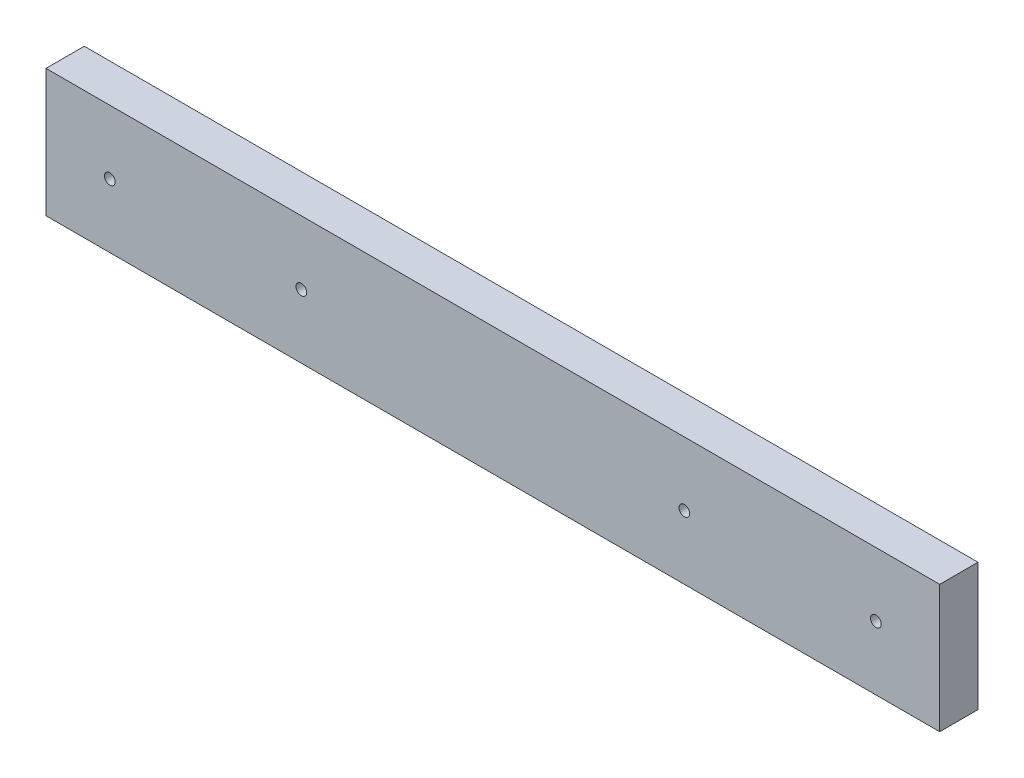
ISO-10303-21;
HEADER;
FILE_DESCRIPTION(('STEP AP214'),'2;1');
FILE_NAME('part.step','',(''),(''),'','','');
FILE_SCHEMA(('AUTOMOTIVE_DESIGN { 1 0 10303 214 1 1 1 1 }'));
ENDSEC;
DATA;
#1=APPLICATION_CONTEXT('core data for automotive mechanical design processes');
#2=APPLICATION_PROTOCOL_DEFINITION('international standard','automotive_design',2000,#1);
#3=PRODUCT_CONTEXT('',#1,'mechanical');
#4=PRODUCT('Part','Part','',(#3));
#5=PRODUCT_RELATED_PRODUCT_CATEGORY('part','',(#4));
#6=PRODUCT_DEFINITION_FORMATION('','',#4);
#7=PRODUCT_DEFINITION_CONTEXT('part definition',#1,'design');
#8=PRODUCT_DEFINITION('design','',#6,#7);
#9=PRODUCT_DEFINITION_SHAPE('','',#8);
#10=(LENGTH_UNIT() NAMED_UNIT(*) SI_UNIT(.MILLI.,.METRE.));
#11=(NAMED_UNIT(*) PLANE_ANGLE_UNIT() SI_UNIT($,.RADIAN.));
#12=(NAMED_UNIT(*) SI_UNIT($,.STERADIAN.) SOLID_ANGLE_UNIT());
#13=UNCERTAINTY_MEASURE_WITH_UNIT(LENGTH_MEASURE(1.E-05),#10,'distance_accuracy_value','');
#14=(GEOMETRIC_REPRESENTATION_CONTEXT(3) GLOBAL_UNCERTAINTY_ASSIGNED_CONTEXT((#13)) GLOBAL_UNIT_ASSIGNED_CONTEXT((#10,
#11,#12)) REPRESENTATION_CONTEXT('',''));
#15=CARTESIAN_POINT('',(0.,0.,0.));
#16=DIRECTION('',(0.,0.,1.));
#17=DIRECTION('',(1.,0.,0.));
#18=AXIS2_PLACEMENT_3D('',#15,#16,#17);
#19=CARTESIAN_POINT('',(175.,-25.,-15.));
#20=DIRECTION('',(1.,0.,0.));
#21=DIRECTION('',(0.,0.,-1.));
#22=AXIS2_PLACEMENT_3D('',#19,#20,#21);
#23=PLANE('',#22);
#24=DIRECTION('',(0.,1.,0.));
#25=VECTOR('',#24,1.);
#26=CARTESIAN_POINT('',(175.,-25.,0.));
#27=LINE('',#26,#25);
#28=CARTESIAN_POINT('',(175.,-25.,0.));
#29=VERTEX_POINT('',#28);
#30=CARTESIAN_POINT('',(175.,25.,0.));
#31=VERTEX_POINT('',#30);
#32=EDGE_CURVE('E156',#29,#31,#27,.T.);
#33=ORIENTED_EDGE('',*,*,#32,.F.);
#34=DIRECTION('',(0.,0.,1.));
#35=VECTOR('',#34,1.);
#36=CARTESIAN_POINT('',(175.,-25.,-15.));
#37=LINE('',#36,#35);
#38=CARTESIAN_POINT('',(175.,-25.,-15.));
#39=VERTEX_POINT('',#38);
#40=EDGE_CURVE('E11',#39,#29,#37,.T.);
#41=ORIENTED_EDGE('',*,*,#40,.F.);
#42=DIRECTION('',(0.,1.,0.));
#43=VECTOR('',#42,1.);
#44=CARTESIAN_POINT('',(175.,-25.,-15.));
#45=LINE('',#44,#43);
#46=CARTESIAN_POINT('',(175.,25.,-15.));
#47=VERTEX_POINT('',#46);
#48=EDGE_CURVE('E157',#39,#47,#45,.T.);
#49=ORIENTED_EDGE('',*,*,#48,.T.);
#50=DIRECTION('',(0.,0.,1.));
#51=VECTOR('',#50,1.);
#52=CARTESIAN_POINT('',(175.,25.,-15.));
#53=LINE('',#52,#51);
#54=EDGE_CURVE('E50',#47,#31,#53,.T.);
#55=ORIENTED_EDGE('',*,*,#54,.T.);
#56=EDGE_LOOP('',(#33,#41,#49,#55));
#57=FACE_BOUND('',#56,.T.);
#58=ADVANCED_FACE('F47',(#57),#23,.T.);
#59=CARTESIAN_POINT('',(-175.,-25.,-15.));
#60=DIRECTION('',(0.,-1.,0.));
#61=DIRECTION('',(0.,0.,-1.));
#62=AXIS2_PLACEMENT_3D('',#59,#60,#61);
#63=PLANE('',#62);
#64=DIRECTION('',(1.,0.,0.));
#65=VECTOR('',#64,1.);
#66=CARTESIAN_POINT('',(-175.,-25.,0.));
#67=LINE('',#66,#65);
#68=CARTESIAN_POINT('',(-175.,-25.,0.));
#69=VERTEX_POINT('',#68);
#70=EDGE_CURVE('E160',#69,#29,#67,.T.);
#71=ORIENTED_EDGE('',*,*,#70,.F.);
#72=DIRECTION('',(0.,0.,1.));
#73=VECTOR('',#72,1.);
#74=CARTESIAN_POINT('',(-175.,-25.,-15.));
#75=LINE('',#74,#73);
#76=CARTESIAN_POINT('',(-175.,-25.,-15.));
#77=VERTEX_POINT('',#76);
#78=EDGE_CURVE('E57',#77,#69,#75,.T.);
#79=ORIENTED_EDGE('',*,*,#78,.F.);
#80=DIRECTION('',(1.,0.,0.));
#81=VECTOR('',#80,1.);
#82=CARTESIAN_POINT('',(-175.,-25.,-15.));
#83=LINE('',#82,#81);
#84=EDGE_CURVE('E166',#77,#39,#83,.T.);
#85=ORIENTED_EDGE('',*,*,#84,.T.);
#86=ORIENTED_EDGE('',*,*,#40,.T.);
#87=EDGE_LOOP('',(#71,#79,#85,#86));
#88=FACE_BOUND('',#87,.T.);
#89=ADVANCED_FACE('F188',(#88),#63,.T.);
#90=CARTESIAN_POINT('',(-175.,-25.,-15.));
#91=DIRECTION('',(-1.,0.,0.));
#92=DIRECTION('',(0.,0.,1.));
#93=AXIS2_PLACEMENT_3D('',#90,#91,#92);
#94=PLANE('',#93);
#95=DIRECTION('',(0.,-1.,0.));
#96=VECTOR('',#95,1.);
#97=CARTESIAN_POINT('',(-175.,-25.,0.));
#98=LINE('',#97,#96);
#99=CARTESIAN_POINT('',(-175.,25.,0.));
#100=VERTEX_POINT('',#99);
#101=EDGE_CURVE('E176',#100,#69,#98,.T.);
#102=ORIENTED_EDGE('',*,*,#101,.F.);
#103=DIRECTION('',(0.,0.,1.));
#104=VECTOR('',#103,1.);
#105=CARTESIAN_POINT('',(-175.,25.,-15.));
#106=LINE('',#105,#104);
#107=CARTESIAN_POINT('',(-175.,25.,-15.));
#108=VERTEX_POINT('',#107);
#109=EDGE_CURVE('E183',#108,#100,#106,.T.);
#110=ORIENTED_EDGE('',*,*,#109,.F.);
#111=DIRECTION('',(0.,-1.,0.));
#112=VECTOR('',#111,1.);
#113=CARTESIAN_POINT('',(-175.,-25.,-15.));
#114=LINE('',#113,#112);
#115=EDGE_CURVE('E163',#108,#77,#114,.T.);
#116=ORIENTED_EDGE('',*,*,#115,.T.);
#117=ORIENTED_EDGE('',*,*,#78,.T.);
#118=EDGE_LOOP('',(#102,#110,#116,#117));
#119=FACE_BOUND('',#118,.T.);
#120=ADVANCED_FACE('F191',(#119),#94,.T.);
#121=CARTESIAN_POINT('',(-175.,25.,-15.));
#122=DIRECTION('',(0.,1.,0.));
#123=DIRECTION('',(0.,0.,1.));
#124=AXIS2_PLACEMENT_3D('',#121,#122,#123);
#125=PLANE('',#124);
#126=DIRECTION('',(-1.,0.,0.));
#127=VECTOR('',#126,1.);
#128=CARTESIAN_POINT('',(-175.,25.,0.));
#129=LINE('',#128,#127);
#130=EDGE_CURVE('E172',#31,#100,#129,.T.);
#131=ORIENTED_EDGE('',*,*,#130,.F.);
#132=ORIENTED_EDGE('',*,*,#54,.F.);
#133=DIRECTION('',(-1.,0.,0.));
#134=VECTOR('',#133,1.);
#135=CARTESIAN_POINT('',(-175.,25.,-15.));
#136=LINE('',#135,#134);
#137=EDGE_CURVE('E159',#47,#108,#136,.T.);
#138=ORIENTED_EDGE('',*,*,#137,.T.);
#139=ORIENTED_EDGE('',*,*,#109,.T.);
#140=EDGE_LOOP('',(#131,#132,#138,#139));
#141=FACE_BOUND('',#140,.T.);
#142=ADVANCED_FACE('F185',(#141),#125,.T.);
#143=CARTESIAN_POINT('',(0.,0.,-15.));
#144=DIRECTION('',(0.,0.,-1.));
#145=DIRECTION('',(-1.,0.,0.));
#146=AXIS2_PLACEMENT_3D('',#143,#144,#145);
#147=PLANE('',#146);
#148=ORIENTED_EDGE('',*,*,#48,.F.);
#149=ORIENTED_EDGE('',*,*,#84,.F.);
#150=ORIENTED_EDGE('',*,*,#115,.F.);
#151=ORIENTED_EDGE('',*,*,#137,.F.);
#152=EDGE_LOOP('',(#148,#149,#150,#151));
#153=FACE_BOUND('',#152,.T.);
#154=ADVANCED_FACE('F193',(#153),#147,.T.);
#155=CARTESIAN_POINT('',(0.,0.,0.));
#156=DIRECTION('',(0.,0.,-1.));
#157=DIRECTION('',(-1.,0.,0.));
#158=AXIS2_PLACEMENT_3D('',#155,#156,#157);
#159=PLANE('',#158);
#160=CARTESIAN_POINT('',(-150.,0.,0.));
#161=DIRECTION('',(0.,0.,1.));
#162=DIRECTION('',(1.,0.,0.));
#163=AXIS2_PLACEMENT_3D('',#160,#161,#162);
#164=CIRCLE('',#163,2.09999999999999);
#165=CARTESIAN_POINT('',(-147.9,0.,0.));
#166=VERTEX_POINT('',#165);
#167=EDGE_CURVE('E126',#166,#166,#164,.T.);
#168=ORIENTED_EDGE('',*,*,#167,.F.);
#169=EDGE_LOOP('',(#168));
#170=FACE_BOUND('',#169,.T.);
#171=CARTESIAN_POINT('',(-75.,0.,0.));
#172=DIRECTION('',(0.,0.,1.));
#173=DIRECTION('',(1.,0.,0.));
#174=AXIS2_PLACEMENT_3D('',#171,#172,#173);
#175=CIRCLE('',#174,2.09999999999999);
#176=CARTESIAN_POINT('',(-72.9,0.,0.));
#177=VERTEX_POINT('',#176);
#178=EDGE_CURVE('E125',#177,#177,#175,.T.);
#179=ORIENTED_EDGE('',*,*,#178,.F.);
#180=EDGE_LOOP('',(#179));
#181=FACE_BOUND('',#180,.T.);
#182=CARTESIAN_POINT('',(75.,0.,0.));
#183=DIRECTION('',(0.,0.,1.));
#184=DIRECTION('',(1.,0.,0.));
#185=AXIS2_PLACEMENT_3D('',#182,#183,#184);
#186=CIRCLE('',#185,2.09999999999999);
#187=CARTESIAN_POINT('',(77.1,0.,0.));
#188=VERTEX_POINT('',#187);
#189=EDGE_CURVE('E141',#188,#188,#186,.T.);
#190=ORIENTED_EDGE('',*,*,#189,.F.);
#191=EDGE_LOOP('',(#190));
#192=FACE_BOUND('',#191,.T.);
#193=CARTESIAN_POINT('',(150.,0.,0.));
#194=DIRECTION('',(0.,0.,1.));
#195=DIRECTION('',(1.,0.,0.));
#196=AXIS2_PLACEMENT_3D('',#193,#194,#195);
#197=CIRCLE('',#196,2.09999999999999);
#198=CARTESIAN_POINT('',(152.1,0.,0.));
#199=VERTEX_POINT('',#198);
#200=EDGE_CURVE('E149',#199,#199,#197,.T.);
#201=ORIENTED_EDGE('',*,*,#200,.F.);
#202=EDGE_LOOP('',(#201));
#203=FACE_BOUND('',#202,.T.);
#204=ORIENTED_EDGE('',*,*,#32,.T.);
#205=ORIENTED_EDGE('',*,*,#130,.T.);
#206=ORIENTED_EDGE('',*,*,#101,.T.);
#207=ORIENTED_EDGE('',*,*,#70,.T.);
#208=EDGE_LOOP('',(#204,#205,#206,#207));
#209=FACE_BOUND('',#208,.T.);
#210=ADVANCED_FACE('F187',(#170,#181,#192,#203,#209),#159,.F.);
#211=CARTESIAN_POINT('',(150.,0.,-12.));
#212=DIRECTION('',(0.,0.,1.));
#213=DIRECTION('',(1.,0.,0.));
#214=AXIS2_PLACEMENT_3D('',#211,#212,#213);
#215=CONICAL_SURFACE('',#214,2.09999999999999,1.02974425867665);
#216=CARTESIAN_POINT('',(150.,0.,-13.2618072999579));
#217=VERTEX_POINT('',#216);
#218=VERTEX_LOOP('',#217);
#219=FACE_BOUND('',#218,.T.);
#220=CARTESIAN_POINT('',(150.,0.,-12.));
#221=DIRECTION('',(0.,0.,1.));
#222=DIRECTION('',(1.,0.,0.));
#223=AXIS2_PLACEMENT_3D('',#220,#221,#222);
#224=CIRCLE('',#223,2.09999999999999);
#225=CARTESIAN_POINT('',(152.1,0.,-12.));
#226=VERTEX_POINT('',#225);
#227=EDGE_CURVE('E153',#226,#226,#224,.T.);
#228=ORIENTED_EDGE('',*,*,#227,.T.);
#229=EDGE_LOOP('',(#228));
#230=FACE_BOUND('',#229,.T.);
#231=ADVANCED_FACE('F200',(#219,#230),#215,.F.);
#232=CARTESIAN_POINT('',(150.,0.,0.));
#233=DIRECTION('',(0.,0.,1.));
#234=DIRECTION('',(1.,0.,0.));
#235=AXIS2_PLACEMENT_3D('',#232,#233,#234);
#236=CYLINDRICAL_SURFACE('',#235,2.09999999999999);
#237=ORIENTED_EDGE('',*,*,#227,.F.);
#238=EDGE_LOOP('',(#237));
#239=FACE_BOUND('',#238,.T.);
#240=ORIENTED_EDGE('',*,*,#200,.T.);
#241=EDGE_LOOP('',(#240));
#242=FACE_BOUND('',#241,.T.);
#243=ADVANCED_FACE('F254',(#239,#242),#236,.F.);
#244=CARTESIAN_POINT('',(75.,0.,-12.));
#245=DIRECTION('',(0.,0.,1.));
#246=DIRECTION('',(1.,0.,0.));
#247=AXIS2_PLACEMENT_3D('',#244,#245,#246);
#248=CONICAL_SURFACE('',#247,2.09999999999999,1.02974425867665);
#249=CARTESIAN_POINT('',(75.,0.,-13.2618072999579));
#250=VERTEX_POINT('',#249);
#251=VERTEX_LOOP('',#250);
#252=FACE_BOUND('',#251,.T.);
#253=CARTESIAN_POINT('',(75.,0.,-12.));
#254=DIRECTION('',(0.,0.,1.));
#255=DIRECTION('',(1.,0.,0.));
#256=AXIS2_PLACEMENT_3D('',#253,#254,#255);
#257=CIRCLE('',#256,2.09999999999999);
#258=CARTESIAN_POINT('',(77.1,0.,-12.));
#259=VERTEX_POINT('',#258);
#260=EDGE_CURVE('E145',#259,#259,#257,.T.);
#261=ORIENTED_EDGE('',*,*,#260,.T.);
#262=EDGE_LOOP('',(#261));
#263=FACE_BOUND('',#262,.T.);
#264=ADVANCED_FACE('F262',(#252,#263),#248,.F.);
#265=CARTESIAN_POINT('',(75.,0.,0.));
#266=DIRECTION('',(0.,0.,1.));
#267=DIRECTION('',(1.,0.,0.));
#268=AXIS2_PLACEMENT_3D('',#265,#266,#267);
#269=CYLINDRICAL_SURFACE('',#268,2.09999999999999);
#270=ORIENTED_EDGE('',*,*,#260,.F.);
#271=EDGE_LOOP('',(#270));
#272=FACE_BOUND('',#271,.T.);
#273=ORIENTED_EDGE('',*,*,#189,.T.);
#274=EDGE_LOOP('',(#273));
#275=FACE_BOUND('',#274,.T.);
#276=ADVANCED_FACE('F272',(#272,#275),#269,.F.);
#277=CARTESIAN_POINT('',(-75.,0.,-12.));
#278=DIRECTION('',(0.,0.,1.));
#279=DIRECTION('',(1.,0.,0.));
#280=AXIS2_PLACEMENT_3D('',#277,#278,#279);
#281=CONICAL_SURFACE('',#280,2.09999999999999,1.02974425867665);
#282=CARTESIAN_POINT('',(-75.,0.,-13.2618072999579));
#283=VERTEX_POINT('',#282);
#284=VERTEX_LOOP('',#283);
#285=FACE_BOUND('',#284,.T.);
#286=CARTESIAN_POINT('',(-75.,0.,-12.));
#287=DIRECTION('',(0.,0.,1.));
#288=DIRECTION('',(1.,0.,0.));
#289=AXIS2_PLACEMENT_3D('',#286,#287,#288);
#290=CIRCLE('',#289,2.09999999999999);
#291=CARTESIAN_POINT('',(-72.9,0.,-12.));
#292=VERTEX_POINT('',#291);
#293=EDGE_CURVE('E132',#292,#292,#290,.T.);
#294=ORIENTED_EDGE('',*,*,#293,.T.);
#295=EDGE_LOOP('',(#294));
#296=FACE_BOUND('',#295,.T.);
#297=ADVANCED_FACE('F281',(#285,#296),#281,.F.);
#298=CARTESIAN_POINT('',(-75.,0.,0.));
#299=DIRECTION('',(0.,0.,1.));
#300=DIRECTION('',(1.,0.,0.));
#301=AXIS2_PLACEMENT_3D('',#298,#299,#300);
#302=CYLINDRICAL_SURFACE('',#301,2.09999999999999);
#303=ORIENTED_EDGE('',*,*,#293,.F.);
#304=EDGE_LOOP('',(#303));
#305=FACE_BOUND('',#304,.T.);
#306=ORIENTED_EDGE('',*,*,#178,.T.);
#307=EDGE_LOOP('',(#306));
#308=FACE_BOUND('',#307,.T.);
#309=ADVANCED_FACE('F118',(#305,#308),#302,.F.);
#310=CARTESIAN_POINT('',(-150.,0.,-12.));
#311=DIRECTION('',(0.,0.,1.));
#312=DIRECTION('',(1.,0.,0.));
#313=AXIS2_PLACEMENT_3D('',#310,#311,#312);
#314=CONICAL_SURFACE('',#313,2.09999999999999,1.02974425867665);
#315=CARTESIAN_POINT('',(-150.,0.,-13.2618072999579));
#316=VERTEX_POINT('',#315);
#317=VERTEX_LOOP('',#316);
#318=FACE_BOUND('',#317,.T.);
#319=CARTESIAN_POINT('',(-150.,0.,-12.));
#320=DIRECTION('',(0.,0.,1.));
#321=DIRECTION('',(1.,0.,0.));
#322=AXIS2_PLACEMENT_3D('',#319,#320,#321);
#323=CIRCLE('',#322,2.09999999999999);
#324=CARTESIAN_POINT('',(-147.9,0.,-12.));
#325=VERTEX_POINT('',#324);
#326=EDGE_CURVE('E122',#325,#325,#323,.T.);
#327=ORIENTED_EDGE('',*,*,#326,.T.);
#328=EDGE_LOOP('',(#327));
#329=FACE_BOUND('',#328,.T.);
#330=ADVANCED_FACE('F114',(#318,#329),#314,.F.);
#331=CARTESIAN_POINT('',(-150.,0.,0.));
#332=DIRECTION('',(0.,0.,1.));
#333=DIRECTION('',(1.,0.,0.));
#334=AXIS2_PLACEMENT_3D('',#331,#332,#333);
#335=CYLINDRICAL_SURFACE('',#334,2.09999999999999);
#336=ORIENTED_EDGE('',*,*,#326,.F.);
#337=EDGE_LOOP('',(#336));
#338=FACE_BOUND('',#337,.T.);
#339=ORIENTED_EDGE('',*,*,#167,.T.);
#340=EDGE_LOOP('',(#339));
#341=FACE_BOUND('',#340,.T.);
#342=ADVANCED_FACE('F117',(#338,#341),#335,.F.);
#343=CLOSED_SHELL('',(#58,#89,#120,#142,#154,#210,#231,#243,#264,#276,#297,#309,#330,#342));
#344=MANIFOLD_SOLID_BREP('B2',#343);
#345=ADVANCED_BREP_SHAPE_REPRESENTATION('',(#18,#344),#14);
#346=SHAPE_DEFINITION_REPRESENTATION(#9,#345);
ENDSEC;
END-ISO-10303-21;
